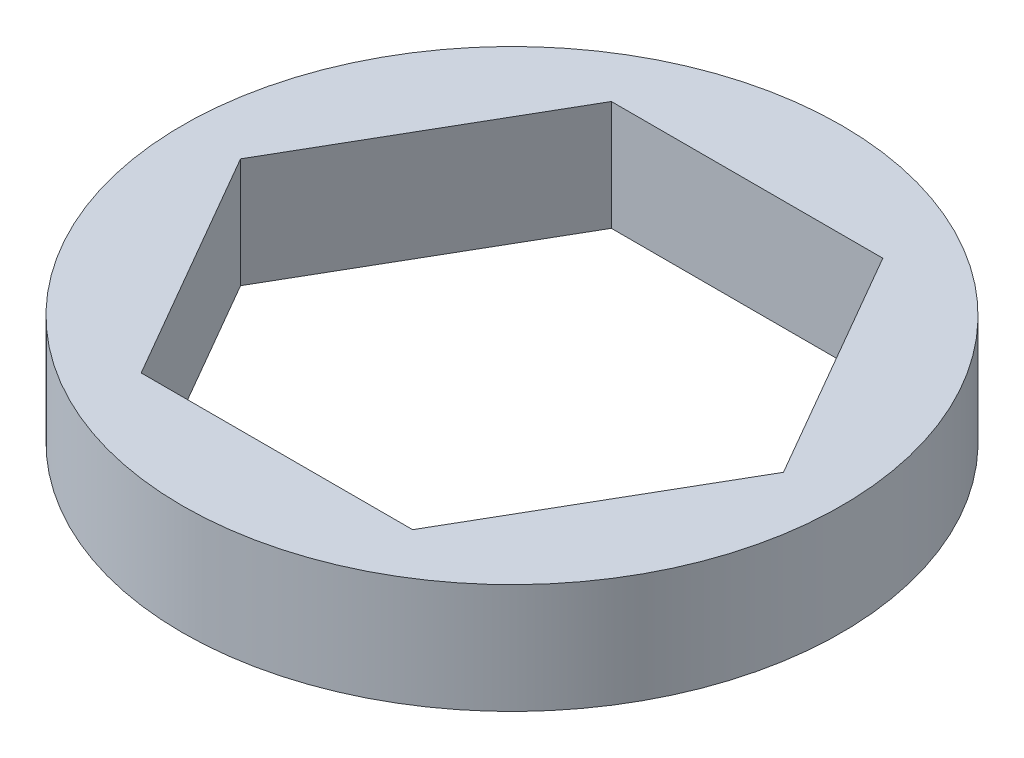
ISO-10303-21;
HEADER;
FILE_DESCRIPTION(('STEP AP214'),'2;1');
FILE_NAME('part.step','',(''),(''),'','','');
FILE_SCHEMA(('AUTOMOTIVE_DESIGN { 1 0 10303 214 1 1 1 1 }'));
ENDSEC;
DATA;
#1=APPLICATION_CONTEXT('core data for automotive mechanical design processes');
#2=APPLICATION_PROTOCOL_DEFINITION('international standard','automotive_design',2000,#1);
#3=PRODUCT_CONTEXT('',#1,'mechanical');
#4=PRODUCT('Part','Part','',(#3));
#5=PRODUCT_RELATED_PRODUCT_CATEGORY('part','',(#4));
#6=PRODUCT_DEFINITION_FORMATION('','',#4);
#7=PRODUCT_DEFINITION_CONTEXT('part definition',#1,'design');
#8=PRODUCT_DEFINITION('design','',#6,#7);
#9=PRODUCT_DEFINITION_SHAPE('','',#8);
#10=(LENGTH_UNIT() NAMED_UNIT(*) SI_UNIT(.MILLI.,.METRE.));
#11=(NAMED_UNIT(*) PLANE_ANGLE_UNIT() SI_UNIT($,.RADIAN.));
#12=(NAMED_UNIT(*) SI_UNIT($,.STERADIAN.) SOLID_ANGLE_UNIT());
#13=UNCERTAINTY_MEASURE_WITH_UNIT(LENGTH_MEASURE(1.E-05),#10,'distance_accuracy_value','');
#14=(GEOMETRIC_REPRESENTATION_CONTEXT(3) GLOBAL_UNCERTAINTY_ASSIGNED_CONTEXT((#13)) GLOBAL_UNIT_ASSIGNED_CONTEXT((#10,
#11,#12)) REPRESENTATION_CONTEXT('',''));
#15=CARTESIAN_POINT('',(0.,0.,0.));
#16=DIRECTION('',(0.,0.,1.));
#17=DIRECTION('',(1.,0.,0.));
#18=AXIS2_PLACEMENT_3D('',#15,#16,#17);
#19=CARTESIAN_POINT('',(0.,3.175,0.));
#20=DIRECTION('',(0.,1.,0.));
#21=DIRECTION('',(0.,0.,1.));
#22=AXIS2_PLACEMENT_3D('',#19,#20,#21);
#23=PLANE('',#22);
#24=CARTESIAN_POINT('',(0.,3.175,0.));
#25=DIRECTION('',(0.,1.,0.));
#26=DIRECTION('',(0.,0.,1.));
#27=AXIS2_PLACEMENT_3D('',#24,#25,#26);
#28=CIRCLE('',#27,9.525);
#29=CARTESIAN_POINT('',(0.,3.175,9.525));
#30=VERTEX_POINT('',#29);
#31=EDGE_CURVE('E11',#30,#30,#28,.T.);
#32=ORIENTED_EDGE('',*,*,#31,.T.);
#33=EDGE_LOOP('',(#32));
#34=FACE_BOUND('',#33,.T.);
#35=DIRECTION('',(0.5,0.,-0.866025403784439));
#36=VECTOR('',#35,1.);
#37=CARTESIAN_POINT('',(3.9228064040089,3.175,6.79449999999997));
#38=LINE('',#37,#36);
#39=CARTESIAN_POINT('',(3.9228064040089,3.175,6.79449999999997));
#40=VERTEX_POINT('',#39);
#41=CARTESIAN_POINT('',(7.84561280801779,3.175,0.));
#42=VERTEX_POINT('',#41);
#43=EDGE_CURVE('E94',#40,#42,#38,.T.);
#44=ORIENTED_EDGE('',*,*,#43,.F.);
#45=DIRECTION('',(1.,0.,0.));
#46=VECTOR('',#45,1.);
#47=CARTESIAN_POINT('',(-3.9228064040089,3.175,6.79449999999997));
#48=LINE('',#47,#46);
#49=CARTESIAN_POINT('',(-3.9228064040089,3.175,6.79449999999997));
#50=VERTEX_POINT('',#49);
#51=EDGE_CURVE('E86',#50,#40,#48,.T.);
#52=ORIENTED_EDGE('',*,*,#51,.F.);
#53=DIRECTION('',(0.5,0.,0.866025403784439));
#54=VECTOR('',#53,1.);
#55=CARTESIAN_POINT('',(-7.84561280801779,3.175,0.));
#56=LINE('',#55,#54);
#57=CARTESIAN_POINT('',(-7.84561280801779,3.175,0.));
#58=VERTEX_POINT('',#57);
#59=EDGE_CURVE('E114',#58,#50,#56,.T.);
#60=ORIENTED_EDGE('',*,*,#59,.F.);
#61=DIRECTION('',(-0.5,0.,0.866025403784439));
#62=VECTOR('',#61,1.);
#63=CARTESIAN_POINT('',(-3.9228064040089,3.175,-6.79449999999997));
#64=LINE('',#63,#62);
#65=CARTESIAN_POINT('',(-3.9228064040089,3.175,-6.79449999999997));
#66=VERTEX_POINT('',#65);
#67=EDGE_CURVE('E112',#66,#58,#64,.T.);
#68=ORIENTED_EDGE('',*,*,#67,.F.);
#69=DIRECTION('',(-1.,0.,0.));
#70=VECTOR('',#69,1.);
#71=CARTESIAN_POINT('',(3.92280640400889,3.175,-6.79449999999997));
#72=LINE('',#71,#70);
#73=CARTESIAN_POINT('',(3.92280640400889,3.175,-6.79449999999997));
#74=VERTEX_POINT('',#73);
#75=EDGE_CURVE('E108',#74,#66,#72,.T.);
#76=ORIENTED_EDGE('',*,*,#75,.F.);
#77=DIRECTION('',(-0.5,0.,-0.866025403784439));
#78=VECTOR('',#77,1.);
#79=CARTESIAN_POINT('',(7.84561280801779,3.175,0.));
#80=LINE('',#79,#78);
#81=EDGE_CURVE('E106',#42,#74,#80,.T.);
#82=ORIENTED_EDGE('',*,*,#81,.F.);
#83=EDGE_LOOP('',(#44,#52,#60,#68,#76,#82));
#84=FACE_BOUND('',#83,.T.);
#85=ADVANCED_FACE('F33',(#34,#84),#23,.T.);
#86=CARTESIAN_POINT('',(0.,0.,0.));
#87=DIRECTION('',(0.,1.,0.));
#88=DIRECTION('',(0.,0.,1.));
#89=AXIS2_PLACEMENT_3D('',#86,#87,#88);
#90=PLANE('',#89);
#91=CARTESIAN_POINT('',(0.,0.,0.));
#92=DIRECTION('',(0.,1.,0.));
#93=DIRECTION('',(0.,0.,1.));
#94=AXIS2_PLACEMENT_3D('',#91,#92,#93);
#95=CIRCLE('',#94,9.525);
#96=CARTESIAN_POINT('',(0.,0.,9.525));
#97=VERTEX_POINT('',#96);
#98=EDGE_CURVE('E37',#97,#97,#95,.T.);
#99=ORIENTED_EDGE('',*,*,#98,.F.);
#100=EDGE_LOOP('',(#99));
#101=FACE_BOUND('',#100,.T.);
#102=DIRECTION('',(1.,0.,0.));
#103=VECTOR('',#102,1.);
#104=CARTESIAN_POINT('',(-3.9228064040089,0.,6.79449999999997));
#105=LINE('',#104,#103);
#106=CARTESIAN_POINT('',(-3.9228064040089,0.,6.79449999999997));
#107=VERTEX_POINT('',#106);
#108=CARTESIAN_POINT('',(3.9228064040089,0.,6.79449999999997));
#109=VERTEX_POINT('',#108);
#110=EDGE_CURVE('E56',#107,#109,#105,.T.);
#111=ORIENTED_EDGE('',*,*,#110,.T.);
#112=DIRECTION('',(0.5,0.,-0.866025403784439));
#113=VECTOR('',#112,1.);
#114=CARTESIAN_POINT('',(3.9228064040089,0.,6.79449999999997));
#115=LINE('',#114,#113);
#116=CARTESIAN_POINT('',(7.84561280801779,0.,0.));
#117=VERTEX_POINT('',#116);
#118=EDGE_CURVE('E101',#109,#117,#115,.T.);
#119=ORIENTED_EDGE('',*,*,#118,.T.);
#120=DIRECTION('',(-0.5,0.,-0.866025403784439));
#121=VECTOR('',#120,1.);
#122=CARTESIAN_POINT('',(7.84561280801779,0.,0.));
#123=LINE('',#122,#121);
#124=CARTESIAN_POINT('',(3.92280640400889,0.,-6.79449999999997));
#125=VERTEX_POINT('',#124);
#126=EDGE_CURVE('E118',#117,#125,#123,.T.);
#127=ORIENTED_EDGE('',*,*,#126,.T.);
#128=DIRECTION('',(-1.,0.,0.));
#129=VECTOR('',#128,1.);
#130=CARTESIAN_POINT('',(3.92280640400889,0.,-6.79449999999997));
#131=LINE('',#130,#129);
#132=CARTESIAN_POINT('',(-3.9228064040089,0.,-6.79449999999997));
#133=VERTEX_POINT('',#132);
#134=EDGE_CURVE('E121',#125,#133,#131,.T.);
#135=ORIENTED_EDGE('',*,*,#134,.T.);
#136=DIRECTION('',(-0.5,0.,0.866025403784439));
#137=VECTOR('',#136,1.);
#138=CARTESIAN_POINT('',(-3.9228064040089,0.,-6.79449999999997));
#139=LINE('',#138,#137);
#140=CARTESIAN_POINT('',(-7.84561280801779,0.,0.));
#141=VERTEX_POINT('',#140);
#142=EDGE_CURVE('E124',#133,#141,#139,.T.);
#143=ORIENTED_EDGE('',*,*,#142,.T.);
#144=DIRECTION('',(0.5,0.,0.866025403784439));
#145=VECTOR('',#144,1.);
#146=CARTESIAN_POINT('',(-7.84561280801779,0.,0.));
#147=LINE('',#146,#145);
#148=EDGE_CURVE('E95',#141,#107,#147,.T.);
#149=ORIENTED_EDGE('',*,*,#148,.T.);
#150=EDGE_LOOP('',(#111,#119,#127,#135,#143,#149));
#151=FACE_BOUND('',#150,.T.);
#152=ADVANCED_FACE('F141',(#101,#151),#90,.F.);
#153=CARTESIAN_POINT('',(0.,3.175,0.));
#154=DIRECTION('',(0.,-1.,0.));
#155=DIRECTION('',(0.,0.,-1.));
#156=AXIS2_PLACEMENT_3D('',#153,#154,#155);
#157=CYLINDRICAL_SURFACE('',#156,9.525);
#158=ORIENTED_EDGE('',*,*,#31,.F.);
#159=EDGE_LOOP('',(#158));
#160=FACE_BOUND('',#159,.T.);
#161=ORIENTED_EDGE('',*,*,#98,.T.);
#162=EDGE_LOOP('',(#161));
#163=FACE_BOUND('',#162,.T.);
#164=ADVANCED_FACE('F35',(#160,#163),#157,.T.);
#165=CARTESIAN_POINT('',(-3.9228064040089,3.175,6.79449999999997));
#166=DIRECTION('',(0.,0.,-1.));
#167=DIRECTION('',(-1.,0.,0.));
#168=AXIS2_PLACEMENT_3D('',#165,#166,#167);
#169=PLANE('',#168);
#170=ORIENTED_EDGE('',*,*,#110,.F.);
#171=DIRECTION('',(0.,-1.,0.));
#172=VECTOR('',#171,1.);
#173=CARTESIAN_POINT('',(-3.9228064040089,3.175,6.79449999999997));
#174=LINE('',#173,#172);
#175=EDGE_CURVE('E90',#50,#107,#174,.T.);
#176=ORIENTED_EDGE('',*,*,#175,.F.);
#177=ORIENTED_EDGE('',*,*,#51,.T.);
#178=DIRECTION('',(0.,-1.,0.));
#179=VECTOR('',#178,1.);
#180=CARTESIAN_POINT('',(3.9228064040089,3.175,6.79449999999997));
#181=LINE('',#180,#179);
#182=EDGE_CURVE('E89',#40,#109,#181,.T.);
#183=ORIENTED_EDGE('',*,*,#182,.T.);
#184=EDGE_LOOP('',(#170,#176,#177,#183));
#185=FACE_BOUND('',#184,.T.);
#186=ADVANCED_FACE('F88',(#185),#169,.T.);
#187=CARTESIAN_POINT('',(3.9228064040089,3.175,6.79449999999997));
#188=DIRECTION('',(-0.866025403784439,0.,-0.5));
#189=DIRECTION('',(-0.5,0.,0.866025403784439));
#190=AXIS2_PLACEMENT_3D('',#187,#188,#189);
#191=PLANE('',#190);
#192=ORIENTED_EDGE('',*,*,#118,.F.);
#193=ORIENTED_EDGE('',*,*,#182,.F.);
#194=ORIENTED_EDGE('',*,*,#43,.T.);
#195=DIRECTION('',(0.,-1.,0.));
#196=VECTOR('',#195,1.);
#197=CARTESIAN_POINT('',(7.84561280801779,3.175,0.));
#198=LINE('',#197,#196);
#199=EDGE_CURVE('E102',#42,#117,#198,.T.);
#200=ORIENTED_EDGE('',*,*,#199,.T.);
#201=EDGE_LOOP('',(#192,#193,#194,#200));
#202=FACE_BOUND('',#201,.T.);
#203=ADVANCED_FACE('F98',(#202),#191,.T.);
#204=CARTESIAN_POINT('',(7.84561280801779,3.175,0.));
#205=DIRECTION('',(-0.866025403784439,0.,0.5));
#206=DIRECTION('',(0.5,0.,0.866025403784439));
#207=AXIS2_PLACEMENT_3D('',#204,#205,#206);
#208=PLANE('',#207);
#209=ORIENTED_EDGE('',*,*,#126,.F.);
#210=ORIENTED_EDGE('',*,*,#199,.F.);
#211=ORIENTED_EDGE('',*,*,#81,.T.);
#212=DIRECTION('',(0.,-1.,0.));
#213=VECTOR('',#212,1.);
#214=CARTESIAN_POINT('',(3.92280640400889,3.175,-6.79449999999997));
#215=LINE('',#214,#213);
#216=EDGE_CURVE('E133',#74,#125,#215,.T.);
#217=ORIENTED_EDGE('',*,*,#216,.T.);
#218=EDGE_LOOP('',(#209,#210,#211,#217));
#219=FACE_BOUND('',#218,.T.);
#220=ADVANCED_FACE('F137',(#219),#208,.T.);
#221=CARTESIAN_POINT('',(3.92280640400889,3.175,-6.79449999999997));
#222=DIRECTION('',(0.,0.,1.));
#223=DIRECTION('',(1.,0.,0.));
#224=AXIS2_PLACEMENT_3D('',#221,#222,#223);
#225=PLANE('',#224);
#226=ORIENTED_EDGE('',*,*,#134,.F.);
#227=ORIENTED_EDGE('',*,*,#216,.F.);
#228=ORIENTED_EDGE('',*,*,#75,.T.);
#229=DIRECTION('',(0.,-1.,0.));
#230=VECTOR('',#229,1.);
#231=CARTESIAN_POINT('',(-3.9228064040089,3.175,-6.79449999999997));
#232=LINE('',#231,#230);
#233=EDGE_CURVE('E131',#66,#133,#232,.T.);
#234=ORIENTED_EDGE('',*,*,#233,.T.);
#235=EDGE_LOOP('',(#226,#227,#228,#234));
#236=FACE_BOUND('',#235,.T.);
#237=ADVANCED_FACE('F149',(#236),#225,.T.);
#238=CARTESIAN_POINT('',(-3.9228064040089,3.175,-6.79449999999997));
#239=DIRECTION('',(0.866025403784439,0.,0.5));
#240=DIRECTION('',(0.5,0.,-0.866025403784439));
#241=AXIS2_PLACEMENT_3D('',#238,#239,#240);
#242=PLANE('',#241);
#243=ORIENTED_EDGE('',*,*,#142,.F.);
#244=ORIENTED_EDGE('',*,*,#233,.F.);
#245=ORIENTED_EDGE('',*,*,#67,.T.);
#246=DIRECTION('',(0.,-1.,0.));
#247=VECTOR('',#246,1.);
#248=CARTESIAN_POINT('',(-7.84561280801779,3.175,0.));
#249=LINE('',#248,#247);
#250=EDGE_CURVE('E48',#58,#141,#249,.T.);
#251=ORIENTED_EDGE('',*,*,#250,.T.);
#252=EDGE_LOOP('',(#243,#244,#245,#251));
#253=FACE_BOUND('',#252,.T.);
#254=ADVANCED_FACE('F147',(#253),#242,.T.);
#255=CARTESIAN_POINT('',(-7.84561280801779,3.175,0.));
#256=DIRECTION('',(0.866025403784439,0.,-0.5));
#257=DIRECTION('',(-0.5,0.,-0.866025403784439));
#258=AXIS2_PLACEMENT_3D('',#255,#256,#257);
#259=PLANE('',#258);
#260=ORIENTED_EDGE('',*,*,#148,.F.);
#261=ORIENTED_EDGE('',*,*,#250,.F.);
#262=ORIENTED_EDGE('',*,*,#59,.T.);
#263=ORIENTED_EDGE('',*,*,#175,.T.);
#264=EDGE_LOOP('',(#260,#261,#262,#263));
#265=FACE_BOUND('',#264,.T.);
#266=ADVANCED_FACE('F143',(#265),#259,.T.);
#267=CLOSED_SHELL('',(#85,#152,#164,#186,#203,#220,#237,#254,#266));
#268=MANIFOLD_SOLID_BREP('B2',#267);
#269=ADVANCED_BREP_SHAPE_REPRESENTATION('',(#18,#268),#14);
#270=SHAPE_DEFINITION_REPRESENTATION(#9,#269);
ENDSEC;
END-ISO-10303-21;
